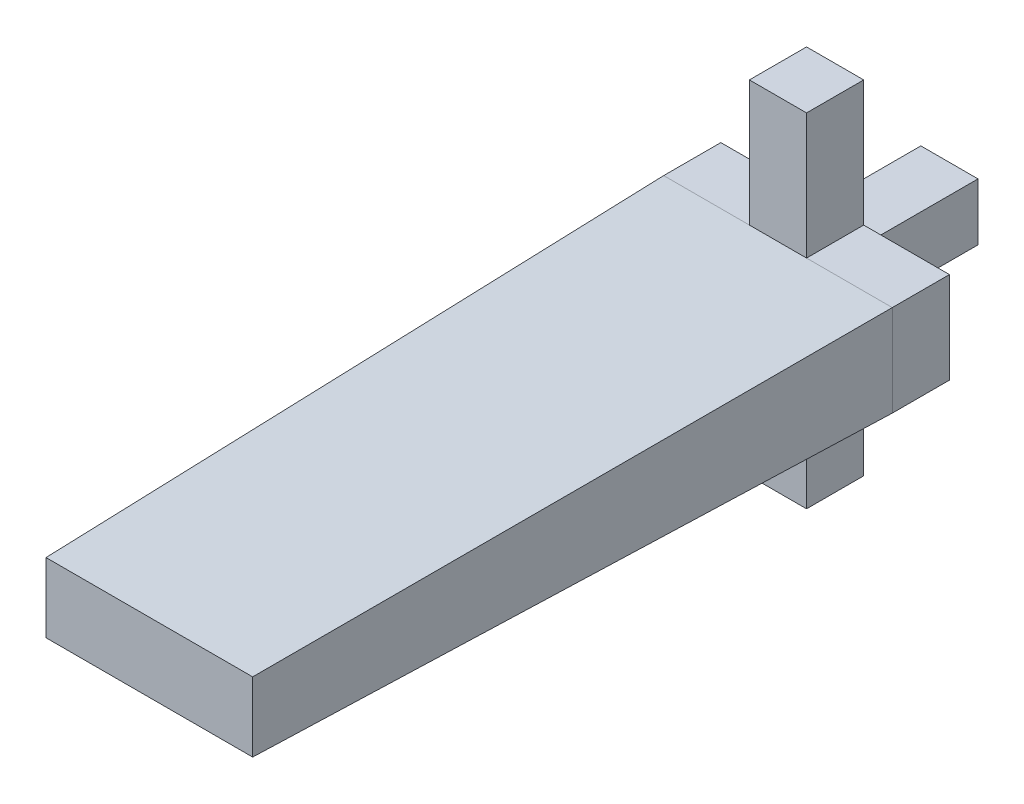
ISO-10303-21;
HEADER;
FILE_DESCRIPTION(('STEP AP214'),'2;1');
FILE_NAME('part.step','',(''),(''),'','','');
FILE_SCHEMA(('AUTOMOTIVE_DESIGN { 1 0 10303 214 1 1 1 1 }'));
ENDSEC;
DATA;
#1=APPLICATION_CONTEXT('core data for automotive mechanical design processes');
#2=APPLICATION_PROTOCOL_DEFINITION('international standard','automotive_design',2000,#1);
#3=PRODUCT_CONTEXT('',#1,'mechanical');
#4=PRODUCT('Part','Part','',(#3));
#5=PRODUCT_RELATED_PRODUCT_CATEGORY('part','',(#4));
#6=PRODUCT_DEFINITION_FORMATION('','',#4);
#7=PRODUCT_DEFINITION_CONTEXT('part definition',#1,'design');
#8=PRODUCT_DEFINITION('design','',#6,#7);
#9=PRODUCT_DEFINITION_SHAPE('','',#8);
#10=(LENGTH_UNIT() NAMED_UNIT(*) SI_UNIT(.MILLI.,.METRE.));
#11=(NAMED_UNIT(*) PLANE_ANGLE_UNIT() SI_UNIT($,.RADIAN.));
#12=(NAMED_UNIT(*) SI_UNIT($,.STERADIAN.) SOLID_ANGLE_UNIT());
#13=UNCERTAINTY_MEASURE_WITH_UNIT(LENGTH_MEASURE(1.E-05),#10,'distance_accuracy_value','');
#14=(GEOMETRIC_REPRESENTATION_CONTEXT(3) GLOBAL_UNCERTAINTY_ASSIGNED_CONTEXT((#13)) GLOBAL_UNIT_ASSIGNED_CONTEXT((#10,
#11,#12)) REPRESENTATION_CONTEXT('',''));
#15=CARTESIAN_POINT('',(0.,0.,0.));
#16=DIRECTION('',(0.,0.,1.));
#17=DIRECTION('',(1.,0.,0.));
#18=AXIS2_PLACEMENT_3D('',#15,#16,#17);
#19=CARTESIAN_POINT('',(-10.,-4.,5.));
#20=DIRECTION('',(0.,1.,0.));
#21=DIRECTION('',(0.,0.,1.));
#22=AXIS2_PLACEMENT_3D('',#19,#20,#21);
#23=PLANE('',#22);
#24=DIRECTION('',(0.,0.,1.));
#25=VECTOR('',#24,1.);
#26=CARTESIAN_POINT('',(2.5,-4.,0.));
#27=LINE('',#26,#25);
#28=CARTESIAN_POINT('',(2.5,-4.,0.));
#29=VERTEX_POINT('',#28);
#30=CARTESIAN_POINT('',(2.5,-4.,5.));
#31=VERTEX_POINT('',#30);
#32=EDGE_CURVE('E182',#29,#31,#27,.T.);
#33=ORIENTED_EDGE('',*,*,#32,.F.);
#34=DIRECTION('',(1.,0.,0.));
#35=VECTOR('',#34,1.);
#36=CARTESIAN_POINT('',(-10.,-4.,0.));
#37=LINE('',#36,#35);
#38=CARTESIAN_POINT('',(10.,-4.,0.));
#39=VERTEX_POINT('',#38);
#40=EDGE_CURVE('E294',#29,#39,#37,.T.);
#41=ORIENTED_EDGE('',*,*,#40,.T.);
#42=DIRECTION('',(0.,0.,-1.));
#43=VECTOR('',#42,1.);
#44=CARTESIAN_POINT('',(10.,-4.,5.));
#45=LINE('',#44,#43);
#46=CARTESIAN_POINT('',(10.,-4.,5.));
#47=VERTEX_POINT('',#46);
#48=EDGE_CURVE('E286',#47,#39,#45,.T.);
#49=ORIENTED_EDGE('',*,*,#48,.F.);
#50=DIRECTION('',(1.,0.,0.));
#51=VECTOR('',#50,1.);
#52=CARTESIAN_POINT('',(-10.,-4.,5.));
#53=LINE('',#52,#51);
#54=EDGE_CURVE('E48',#31,#47,#53,.T.);
#55=ORIENTED_EDGE('',*,*,#54,.F.);
#56=EDGE_LOOP('',(#33,#41,#49,#55));
#57=FACE_BOUND('',#56,.T.);
#58=ADVANCED_FACE('F33',(#57),#23,.F.);
#59=DIRECTION('',(0.,0.,-1.));
#60=VECTOR('',#59,1.);
#61=CARTESIAN_POINT('',(-2.5,-4.,0.));
#62=LINE('',#61,#60);
#63=CARTESIAN_POINT('',(-2.5,-4.,5.));
#64=VERTEX_POINT('',#63);
#65=CARTESIAN_POINT('',(-2.5,-4.,0.));
#66=VERTEX_POINT('',#65);
#67=EDGE_CURVE('E56',#64,#66,#62,.T.);
#68=ORIENTED_EDGE('',*,*,#67,.F.);
#69=CARTESIAN_POINT('',(-10.,-4.,5.));
#70=VERTEX_POINT('',#69);
#71=EDGE_CURVE('E284',#70,#64,#53,.T.);
#72=ORIENTED_EDGE('',*,*,#71,.F.);
#73=DIRECTION('',(0.,0.,-1.));
#74=VECTOR('',#73,1.);
#75=CARTESIAN_POINT('',(-10.,-4.,5.));
#76=LINE('',#75,#74);
#77=CARTESIAN_POINT('',(-10.,-4.,0.));
#78=VERTEX_POINT('',#77);
#79=EDGE_CURVE('E298',#70,#78,#76,.T.);
#80=ORIENTED_EDGE('',*,*,#79,.T.);
#81=EDGE_CURVE('E277',#78,#66,#37,.T.);
#82=ORIENTED_EDGE('',*,*,#81,.T.);
#83=EDGE_LOOP('',(#68,#72,#80,#82));
#84=FACE_BOUND('',#83,.T.);
#85=ADVANCED_FACE('F317',(#84),#23,.F.);
#86=CARTESIAN_POINT('',(-10.,4.,5.));
#87=DIRECTION('',(0.,-1.,0.));
#88=DIRECTION('',(0.,0.,-1.));
#89=AXIS2_PLACEMENT_3D('',#86,#87,#88);
#90=PLANE('',#89);
#91=DIRECTION('',(0.,0.,-1.));
#92=VECTOR('',#91,1.);
#93=CARTESIAN_POINT('',(2.5,4.,0.));
#94=LINE('',#93,#92);
#95=CARTESIAN_POINT('',(2.5,4.,5.));
#96=VERTEX_POINT('',#95);
#97=CARTESIAN_POINT('',(2.5,4.,0.));
#98=VERTEX_POINT('',#97);
#99=EDGE_CURVE('E183',#96,#98,#94,.T.);
#100=ORIENTED_EDGE('',*,*,#99,.F.);
#101=DIRECTION('',(-1.,0.,0.));
#102=VECTOR('',#101,1.);
#103=CARTESIAN_POINT('',(-10.,4.,5.));
#104=LINE('',#103,#102);
#105=CARTESIAN_POINT('',(10.,4.,5.));
#106=VERTEX_POINT('',#105);
#107=EDGE_CURVE('E278',#106,#96,#104,.T.);
#108=ORIENTED_EDGE('',*,*,#107,.F.);
#109=DIRECTION('',(0.,0.,-1.));
#110=VECTOR('',#109,1.);
#111=CARTESIAN_POINT('',(10.,4.,5.));
#112=LINE('',#111,#110);
#113=CARTESIAN_POINT('',(10.,4.,0.));
#114=VERTEX_POINT('',#113);
#115=EDGE_CURVE('E11',#106,#114,#112,.T.);
#116=ORIENTED_EDGE('',*,*,#115,.T.);
#117=DIRECTION('',(-1.,0.,0.));
#118=VECTOR('',#117,1.);
#119=CARTESIAN_POINT('',(-10.,4.,0.));
#120=LINE('',#119,#118);
#121=EDGE_CURVE('E290',#114,#98,#120,.T.);
#122=ORIENTED_EDGE('',*,*,#121,.T.);
#123=EDGE_LOOP('',(#100,#108,#116,#122));
#124=FACE_BOUND('',#123,.T.);
#125=ADVANCED_FACE('F363',(#124),#90,.F.);
#126=DIRECTION('',(0.,0.,1.));
#127=VECTOR('',#126,1.);
#128=CARTESIAN_POINT('',(-2.5,4.,0.));
#129=LINE('',#128,#127);
#130=CARTESIAN_POINT('',(-2.5,4.,0.));
#131=VERTEX_POINT('',#130);
#132=CARTESIAN_POINT('',(-2.5,4.,5.));
#133=VERTEX_POINT('',#132);
#134=EDGE_CURVE('E186',#131,#133,#129,.T.);
#135=ORIENTED_EDGE('',*,*,#134,.F.);
#136=CARTESIAN_POINT('',(-10.,4.,0.));
#137=VERTEX_POINT('',#136);
#138=EDGE_CURVE('E289',#131,#137,#120,.T.);
#139=ORIENTED_EDGE('',*,*,#138,.T.);
#140=DIRECTION('',(0.,0.,-1.));
#141=VECTOR('',#140,1.);
#142=CARTESIAN_POINT('',(-10.,4.,5.));
#143=LINE('',#142,#141);
#144=CARTESIAN_POINT('',(-10.,4.,5.));
#145=VERTEX_POINT('',#144);
#146=EDGE_CURVE('E41',#145,#137,#143,.T.);
#147=ORIENTED_EDGE('',*,*,#146,.F.);
#148=EDGE_CURVE('E276',#133,#145,#104,.T.);
#149=ORIENTED_EDGE('',*,*,#148,.F.);
#150=EDGE_LOOP('',(#135,#139,#147,#149));
#151=FACE_BOUND('',#150,.T.);
#152=ADVANCED_FACE('F347',(#151),#90,.F.);
#153=CARTESIAN_POINT('',(0.,0.,0.));
#154=DIRECTION('',(0.,0.,1.));
#155=DIRECTION('',(1.,0.,0.));
#156=AXIS2_PLACEMENT_3D('',#153,#154,#155);
#157=PLANE('',#156);
#158=DIRECTION('',(0.,1.,0.));
#159=VECTOR('',#158,1.);
#160=CARTESIAN_POINT('',(10.,4.,0.));
#161=LINE('',#160,#159);
#162=EDGE_CURVE('E272',#39,#114,#161,.T.);
#163=ORIENTED_EDGE('',*,*,#162,.F.);
#164=ORIENTED_EDGE('',*,*,#40,.F.);
#165=DIRECTION('',(0.,1.,0.));
#166=VECTOR('',#165,1.);
#167=CARTESIAN_POINT('',(2.5,-15.,0.));
#168=LINE('',#167,#166);
#169=CARTESIAN_POINT('',(2.5,-15.,0.));
#170=VERTEX_POINT('',#169);
#171=EDGE_CURVE('E325',#170,#29,#168,.T.);
#172=ORIENTED_EDGE('',*,*,#171,.F.);
#173=DIRECTION('',(1.,0.,0.));
#174=VECTOR('',#173,1.);
#175=CARTESIAN_POINT('',(2.5,-15.,0.));
#176=LINE('',#175,#174);
#177=CARTESIAN_POINT('',(-2.5,-15.,0.));
#178=VERTEX_POINT('',#177);
#179=EDGE_CURVE('E176',#178,#170,#176,.T.);
#180=ORIENTED_EDGE('',*,*,#179,.F.);
#181=DIRECTION('',(0.,1.,0.));
#182=VECTOR('',#181,1.);
#183=CARTESIAN_POINT('',(-2.5,-15.,0.));
#184=LINE('',#183,#182);
#185=EDGE_CURVE('E188',#178,#66,#184,.T.);
#186=ORIENTED_EDGE('',*,*,#185,.T.);
#187=ORIENTED_EDGE('',*,*,#81,.F.);
#188=DIRECTION('',(0.,-1.,0.));
#189=VECTOR('',#188,1.);
#190=CARTESIAN_POINT('',(-10.,4.,0.));
#191=LINE('',#190,#189);
#192=EDGE_CURVE('E292',#137,#78,#191,.T.);
#193=ORIENTED_EDGE('',*,*,#192,.F.);
#194=ORIENTED_EDGE('',*,*,#138,.F.);
#195=DIRECTION('',(0.,-1.,0.));
#196=VECTOR('',#195,1.);
#197=CARTESIAN_POINT('',(-2.5,15.,0.));
#198=LINE('',#197,#196);
#199=CARTESIAN_POINT('',(-2.5,15.,0.));
#200=VERTEX_POINT('',#199);
#201=EDGE_CURVE('E212',#200,#131,#198,.T.);
#202=ORIENTED_EDGE('',*,*,#201,.F.);
#203=DIRECTION('',(-1.,0.,0.));
#204=VECTOR('',#203,1.);
#205=CARTESIAN_POINT('',(2.5,15.,0.));
#206=LINE('',#205,#204);
#207=CARTESIAN_POINT('',(2.5,15.,0.));
#208=VERTEX_POINT('',#207);
#209=EDGE_CURVE('E195',#208,#200,#206,.T.);
#210=ORIENTED_EDGE('',*,*,#209,.F.);
#211=DIRECTION('',(0.,-1.,0.));
#212=VECTOR('',#211,1.);
#213=CARTESIAN_POINT('',(2.5,15.,0.));
#214=LINE('',#213,#212);
#215=EDGE_CURVE('E215',#208,#98,#214,.T.);
#216=ORIENTED_EDGE('',*,*,#215,.T.);
#217=ORIENTED_EDGE('',*,*,#121,.F.);
#218=EDGE_LOOP('',(#163,#164,#172,#180,#186,#187,#193,#194,#202,#210,#216,#217));
#219=FACE_BOUND('',#218,.T.);
#220=DIRECTION('',(0.,1.,0.));
#221=VECTOR('',#220,1.);
#222=CARTESIAN_POINT('',(-2.5,-2.5,0.));
#223=LINE('',#222,#221);
#224=CARTESIAN_POINT('',(-2.5,-2.5,0.));
#225=VERTEX_POINT('',#224);
#226=CARTESIAN_POINT('',(-2.5,2.5,0.));
#227=VERTEX_POINT('',#226);
#228=EDGE_CURVE('E222',#225,#227,#223,.T.);
#229=ORIENTED_EDGE('',*,*,#228,.F.);
#230=DIRECTION('',(-1.,0.,0.));
#231=VECTOR('',#230,1.);
#232=CARTESIAN_POINT('',(2.5,-2.5,0.));
#233=LINE('',#232,#231);
#234=CARTESIAN_POINT('',(2.5,-2.5,0.));
#235=VERTEX_POINT('',#234);
#236=EDGE_CURVE('E244',#235,#225,#233,.T.);
#237=ORIENTED_EDGE('',*,*,#236,.F.);
#238=DIRECTION('',(0.,-1.,0.));
#239=VECTOR('',#238,1.);
#240=CARTESIAN_POINT('',(2.5,-2.5,0.));
#241=LINE('',#240,#239);
#242=CARTESIAN_POINT('',(2.5,2.5,0.));
#243=VERTEX_POINT('',#242);
#244=EDGE_CURVE('E256',#243,#235,#241,.T.);
#245=ORIENTED_EDGE('',*,*,#244,.F.);
#246=DIRECTION('',(1.,0.,0.));
#247=VECTOR('',#246,1.);
#248=CARTESIAN_POINT('',(2.5,2.5,0.));
#249=LINE('',#248,#247);
#250=EDGE_CURVE('E253',#227,#243,#249,.T.);
#251=ORIENTED_EDGE('',*,*,#250,.F.);
#252=EDGE_LOOP('',(#229,#237,#245,#251));
#253=FACE_BOUND('',#252,.T.);
#254=ADVANCED_FACE('F312',(#219,#253),#157,.F.);
#255=CARTESIAN_POINT('',(10.,4.,5.));
#256=DIRECTION('',(-1.,0.,0.));
#257=DIRECTION('',(0.,0.,1.));
#258=AXIS2_PLACEMENT_3D('',#255,#256,#257);
#259=PLANE('',#258);
#260=ORIENTED_EDGE('',*,*,#162,.T.);
#261=ORIENTED_EDGE('',*,*,#115,.F.);
#262=DIRECTION('',(0.,1.,0.));
#263=VECTOR('',#262,1.);
#264=CARTESIAN_POINT('',(10.,4.,5.));
#265=LINE('',#264,#263);
#266=EDGE_CURVE('E273',#47,#106,#265,.T.);
#267=ORIENTED_EDGE('',*,*,#266,.F.);
#268=ORIENTED_EDGE('',*,*,#48,.T.);
#269=EDGE_LOOP('',(#260,#261,#267,#268));
#270=FACE_BOUND('',#269,.T.);
#271=ADVANCED_FACE('F35',(#270),#259,.F.);
#272=CARTESIAN_POINT('',(-10.,4.,5.));
#273=DIRECTION('',(1.,0.,0.));
#274=DIRECTION('',(0.,0.,-1.));
#275=AXIS2_PLACEMENT_3D('',#272,#273,#274);
#276=PLANE('',#275);
#277=ORIENTED_EDGE('',*,*,#192,.T.);
#278=ORIENTED_EDGE('',*,*,#79,.F.);
#279=DIRECTION('',(0.,-1.,0.));
#280=VECTOR('',#279,1.);
#281=CARTESIAN_POINT('',(-10.,4.,5.));
#282=LINE('',#281,#280);
#283=EDGE_CURVE('E281',#145,#70,#282,.T.);
#284=ORIENTED_EDGE('',*,*,#283,.F.);
#285=ORIENTED_EDGE('',*,*,#146,.T.);
#286=EDGE_LOOP('',(#277,#278,#284,#285));
#287=FACE_BOUND('',#286,.T.);
#288=ADVANCED_FACE('F305',(#287),#276,.F.);
#289=CARTESIAN_POINT('',(-2.5,-2.5,-10.));
#290=DIRECTION('',(1.,0.,0.));
#291=DIRECTION('',(0.,0.,-1.));
#292=AXIS2_PLACEMENT_3D('',#289,#290,#291);
#293=PLANE('',#292);
#294=ORIENTED_EDGE('',*,*,#228,.T.);
#295=DIRECTION('',(0.,0.,1.));
#296=VECTOR('',#295,1.);
#297=CARTESIAN_POINT('',(-2.5,2.5,-10.));
#298=LINE('',#297,#296);
#299=CARTESIAN_POINT('',(-2.5,2.5,-10.));
#300=VERTEX_POINT('',#299);
#301=EDGE_CURVE('E269',#300,#227,#298,.T.);
#302=ORIENTED_EDGE('',*,*,#301,.F.);
#303=DIRECTION('',(0.,1.,0.));
#304=VECTOR('',#303,1.);
#305=CARTESIAN_POINT('',(-2.5,-2.5,-10.));
#306=LINE('',#305,#304);
#307=CARTESIAN_POINT('',(-2.5,-2.5,-10.));
#308=VERTEX_POINT('',#307);
#309=EDGE_CURVE('E240',#308,#300,#306,.T.);
#310=ORIENTED_EDGE('',*,*,#309,.F.);
#311=DIRECTION('',(0.,0.,1.));
#312=VECTOR('',#311,1.);
#313=CARTESIAN_POINT('',(-2.5,-2.5,-10.));
#314=LINE('',#313,#312);
#315=EDGE_CURVE('E250',#308,#225,#314,.T.);
#316=ORIENTED_EDGE('',*,*,#315,.T.);
#317=EDGE_LOOP('',(#294,#302,#310,#316));
#318=FACE_BOUND('',#317,.T.);
#319=ADVANCED_FACE('F377',(#318),#293,.F.);
#320=CARTESIAN_POINT('',(2.5,2.5,-10.));
#321=DIRECTION('',(0.,-1.,0.));
#322=DIRECTION('',(0.,0.,-1.));
#323=AXIS2_PLACEMENT_3D('',#320,#321,#322);
#324=PLANE('',#323);
#325=ORIENTED_EDGE('',*,*,#250,.T.);
#326=DIRECTION('',(0.,0.,1.));
#327=VECTOR('',#326,1.);
#328=CARTESIAN_POINT('',(2.5,2.5,-10.));
#329=LINE('',#328,#327);
#330=CARTESIAN_POINT('',(2.5,2.5,-10.));
#331=VERTEX_POINT('',#330);
#332=EDGE_CURVE('E266',#331,#243,#329,.T.);
#333=ORIENTED_EDGE('',*,*,#332,.F.);
#334=DIRECTION('',(1.,0.,0.));
#335=VECTOR('',#334,1.);
#336=CARTESIAN_POINT('',(2.5,2.5,-10.));
#337=LINE('',#336,#335);
#338=EDGE_CURVE('E243',#300,#331,#337,.T.);
#339=ORIENTED_EDGE('',*,*,#338,.F.);
#340=ORIENTED_EDGE('',*,*,#301,.T.);
#341=EDGE_LOOP('',(#325,#333,#339,#340));
#342=FACE_BOUND('',#341,.T.);
#343=ADVANCED_FACE('F382',(#342),#324,.F.);
#344=CARTESIAN_POINT('',(2.5,-2.5,-10.));
#345=DIRECTION('',(-1.,0.,0.));
#346=DIRECTION('',(0.,0.,1.));
#347=AXIS2_PLACEMENT_3D('',#344,#345,#346);
#348=PLANE('',#347);
#349=ORIENTED_EDGE('',*,*,#244,.T.);
#350=DIRECTION('',(0.,0.,1.));
#351=VECTOR('',#350,1.);
#352=CARTESIAN_POINT('',(2.5,-2.5,-10.));
#353=LINE('',#352,#351);
#354=CARTESIAN_POINT('',(2.5,-2.5,-10.));
#355=VERTEX_POINT('',#354);
#356=EDGE_CURVE('E263',#355,#235,#353,.T.);
#357=ORIENTED_EDGE('',*,*,#356,.F.);
#358=DIRECTION('',(0.,-1.,0.));
#359=VECTOR('',#358,1.);
#360=CARTESIAN_POINT('',(2.5,-2.5,-10.));
#361=LINE('',#360,#359);
#362=EDGE_CURVE('E246',#331,#355,#361,.T.);
#363=ORIENTED_EDGE('',*,*,#362,.F.);
#364=ORIENTED_EDGE('',*,*,#332,.T.);
#365=EDGE_LOOP('',(#349,#357,#363,#364));
#366=FACE_BOUND('',#365,.T.);
#367=ADVANCED_FACE('F510',(#366),#348,.F.);
#368=CARTESIAN_POINT('',(2.5,-2.5,-10.));
#369=DIRECTION('',(0.,1.,0.));
#370=DIRECTION('',(0.,0.,1.));
#371=AXIS2_PLACEMENT_3D('',#368,#369,#370);
#372=PLANE('',#371);
#373=ORIENTED_EDGE('',*,*,#236,.T.);
#374=ORIENTED_EDGE('',*,*,#315,.F.);
#375=DIRECTION('',(-1.,0.,0.));
#376=VECTOR('',#375,1.);
#377=CARTESIAN_POINT('',(2.5,-2.5,-10.));
#378=LINE('',#377,#376);
#379=EDGE_CURVE('E248',#355,#308,#378,.T.);
#380=ORIENTED_EDGE('',*,*,#379,.F.);
#381=ORIENTED_EDGE('',*,*,#356,.T.);
#382=EDGE_LOOP('',(#373,#374,#380,#381));
#383=FACE_BOUND('',#382,.T.);
#384=ADVANCED_FACE('F506',(#383),#372,.F.);
#385=CARTESIAN_POINT('',(0.,0.,-10.));
#386=DIRECTION('',(0.,0.,1.));
#387=DIRECTION('',(1.,0.,0.));
#388=AXIS2_PLACEMENT_3D('',#385,#386,#387);
#389=PLANE('',#388);
#390=ORIENTED_EDGE('',*,*,#309,.T.);
#391=ORIENTED_EDGE('',*,*,#338,.T.);
#392=ORIENTED_EDGE('',*,*,#362,.T.);
#393=ORIENTED_EDGE('',*,*,#379,.T.);
#394=EDGE_LOOP('',(#390,#391,#392,#393));
#395=FACE_BOUND('',#394,.T.);
#396=ADVANCED_FACE('F500',(#395),#389,.F.);
#397=CARTESIAN_POINT('',(10.,4.,5.));
#398=DIRECTION('',(0.999847695156391,0.,0.0174524064372835));
#399=DIRECTION('',(0.0174524064372835,0.,-0.999847695156391));
#400=AXIS2_PLACEMENT_3D('',#397,#398,#399);
#401=PLANE('',#400);
#402=ORIENTED_EDGE('',*,*,#266,.T.);
#403=DIRECTION('',(0.0174497491606827,0.0174497491606827,-0.999695459881887));
#404=VECTOR('',#403,1.);
#405=CARTESIAN_POINT('',(10.,4.,5.));
#406=LINE('',#405,#404);
#407=CARTESIAN_POINT('',(9.03997142894803,3.03997142894803,60.));
#408=VERTEX_POINT('',#407);
#409=EDGE_CURVE('E219',#408,#106,#406,.T.);
#410=ORIENTED_EDGE('',*,*,#409,.F.);
#411=DIRECTION('',(0.,-1.,0.));
#412=VECTOR('',#411,1.);
#413=CARTESIAN_POINT('',(9.03997142894803,0.,60.));
#414=LINE('',#413,#412);
#415=CARTESIAN_POINT('',(9.03997142894803,-3.03997142894803,60.));
#416=VERTEX_POINT('',#415);
#417=EDGE_CURVE('E218',#416,#408,#414,.F.);
#418=ORIENTED_EDGE('',*,*,#417,.F.);
#419=DIRECTION('',(0.0174497491606827,-0.0174497491606827,-0.999695459881887));
#420=VECTOR('',#419,1.);
#421=CARTESIAN_POINT('',(9.99756405003383,-3.99756405003383,5.1395554800961));
#422=LINE('',#421,#420);
#423=EDGE_CURVE('E224',#416,#47,#422,.T.);
#424=ORIENTED_EDGE('',*,*,#423,.T.);
#425=EDGE_LOOP('',(#402,#410,#418,#424));
#426=FACE_BOUND('',#425,.T.);
#427=ADVANCED_FACE('F334',(#426),#401,.T.);
#428=CARTESIAN_POINT('',(10.,4.,5.));
#429=DIRECTION('',(0.,0.999847695156391,0.0174524064372835));
#430=DIRECTION('',(0.,-0.0174524064372835,0.999847695156391));
#431=AXIS2_PLACEMENT_3D('',#428,#429,#430);
#432=PLANE('',#431);
#433=ORIENTED_EDGE('',*,*,#107,.T.);
#434=DIRECTION('',(1.,0.,0.));
#435=VECTOR('',#434,1.);
#436=CARTESIAN_POINT('',(2.5,4.,5.));
#437=LINE('',#436,#435);
#438=EDGE_CURVE('E196',#133,#96,#437,.T.);
#439=ORIENTED_EDGE('',*,*,#438,.F.);
#440=ORIENTED_EDGE('',*,*,#148,.T.);
#441=DIRECTION('',(-0.0174497491606827,0.0174497491606827,-0.999695459881887));
#442=VECTOR('',#441,1.);
#443=CARTESIAN_POINT('',(-10.,4.,5.));
#444=LINE('',#443,#442);
#445=CARTESIAN_POINT('',(-9.03997142894803,3.03997142894803,60.));
#446=VERTEX_POINT('',#445);
#447=EDGE_CURVE('E223',#446,#145,#444,.T.);
#448=ORIENTED_EDGE('',*,*,#447,.F.);
#449=DIRECTION('',(1.,0.,0.));
#450=VECTOR('',#449,1.);
#451=CARTESIAN_POINT('',(0.,3.03997142894803,60.));
#452=LINE('',#451,#450);
#453=EDGE_CURVE('E235',#408,#446,#452,.F.);
#454=ORIENTED_EDGE('',*,*,#453,.F.);
#455=ORIENTED_EDGE('',*,*,#409,.T.);
#456=EDGE_LOOP('',(#433,#439,#440,#448,#454,#455));
#457=FACE_BOUND('',#456,.T.);
#458=ADVANCED_FACE('F346',(#457),#432,.T.);
#459=CARTESIAN_POINT('',(-10.,4.,5.));
#460=DIRECTION('',(-0.999847695156391,0.,0.0174524064372835));
#461=DIRECTION('',(0.0174524064372835,0.,0.999847695156391));
#462=AXIS2_PLACEMENT_3D('',#459,#460,#461);
#463=PLANE('',#462);
#464=ORIENTED_EDGE('',*,*,#283,.T.);
#465=DIRECTION('',(-0.0174497491606827,-0.0174497491606827,-0.999695459881887));
#466=VECTOR('',#465,1.);
#467=CARTESIAN_POINT('',(-9.99391012508459,-3.99391012508458,5.34888870024025));
#468=LINE('',#467,#466);
#469=CARTESIAN_POINT('',(-9.03997142894803,-3.03997142894803,60.));
#470=VERTEX_POINT('',#469);
#471=EDGE_CURVE('E227',#470,#70,#468,.T.);
#472=ORIENTED_EDGE('',*,*,#471,.F.);
#473=DIRECTION('',(0.,1.,0.));
#474=VECTOR('',#473,1.);
#475=CARTESIAN_POINT('',(-9.03997142894803,0.,60.));
#476=LINE('',#475,#474);
#477=EDGE_CURVE('E237',#446,#470,#476,.F.);
#478=ORIENTED_EDGE('',*,*,#477,.F.);
#479=ORIENTED_EDGE('',*,*,#447,.T.);
#480=EDGE_LOOP('',(#464,#472,#478,#479));
#481=FACE_BOUND('',#480,.T.);
#482=ADVANCED_FACE('F342',(#481),#463,.T.);
#483=CARTESIAN_POINT('',(10.,-4.,5.));
#484=DIRECTION('',(0.,-0.999847695156391,0.0174524064372835));
#485=DIRECTION('',(0.,-0.0174524064372835,-0.999847695156391));
#486=AXIS2_PLACEMENT_3D('',#483,#484,#485);
#487=PLANE('',#486);
#488=ORIENTED_EDGE('',*,*,#71,.T.);
#489=DIRECTION('',(-1.,0.,0.));
#490=VECTOR('',#489,1.);
#491=CARTESIAN_POINT('',(2.5,-4.,5.));
#492=LINE('',#491,#490);
#493=EDGE_CURVE('E320',#31,#64,#492,.T.);
#494=ORIENTED_EDGE('',*,*,#493,.F.);
#495=ORIENTED_EDGE('',*,*,#54,.T.);
#496=ORIENTED_EDGE('',*,*,#423,.F.);
#497=DIRECTION('',(-1.,0.,0.));
#498=VECTOR('',#497,1.);
#499=CARTESIAN_POINT('',(0.,-3.03997142894803,60.));
#500=LINE('',#499,#498);
#501=EDGE_CURVE('E228',#470,#416,#500,.F.);
#502=ORIENTED_EDGE('',*,*,#501,.F.);
#503=ORIENTED_EDGE('',*,*,#471,.T.);
#504=EDGE_LOOP('',(#488,#494,#495,#496,#502,#503));
#505=FACE_BOUND('',#504,.T.);
#506=ADVANCED_FACE('F339',(#505),#487,.T.);
#507=CARTESIAN_POINT('',(0.,0.,60.));
#508=DIRECTION('',(0.,0.,-1.));
#509=DIRECTION('',(-1.,0.,0.));
#510=AXIS2_PLACEMENT_3D('',#507,#508,#509);
#511=PLANE('',#510);
#512=ORIENTED_EDGE('',*,*,#417,.T.);
#513=ORIENTED_EDGE('',*,*,#453,.T.);
#514=ORIENTED_EDGE('',*,*,#477,.T.);
#515=ORIENTED_EDGE('',*,*,#501,.T.);
#516=EDGE_LOOP('',(#512,#513,#514,#515));
#517=FACE_BOUND('',#516,.T.);
#518=ADVANCED_FACE('F420',(#517),#511,.F.);
#519=CARTESIAN_POINT('',(2.5,15.,0.));
#520=DIRECTION('',(-1.,0.,0.));
#521=DIRECTION('',(0.,0.,1.));
#522=AXIS2_PLACEMENT_3D('',#519,#520,#521);
#523=PLANE('',#522);
#524=ORIENTED_EDGE('',*,*,#99,.T.);
#525=ORIENTED_EDGE('',*,*,#215,.F.);
#526=DIRECTION('',(0.,0.,-1.));
#527=VECTOR('',#526,1.);
#528=CARTESIAN_POINT('',(2.5,15.,0.));
#529=LINE('',#528,#527);
#530=CARTESIAN_POINT('',(2.5,15.,5.));
#531=VERTEX_POINT('',#530);
#532=EDGE_CURVE('E192',#531,#208,#529,.T.);
#533=ORIENTED_EDGE('',*,*,#532,.F.);
#534=DIRECTION('',(0.,-1.,0.));
#535=VECTOR('',#534,1.);
#536=CARTESIAN_POINT('',(2.5,15.,5.));
#537=LINE('',#536,#535);
#538=EDGE_CURVE('E201',#531,#96,#537,.T.);
#539=ORIENTED_EDGE('',*,*,#538,.T.);
#540=EDGE_LOOP('',(#524,#525,#533,#539));
#541=FACE_BOUND('',#540,.T.);
#542=ADVANCED_FACE('F361',(#541),#523,.F.);
#543=CARTESIAN_POINT('',(-2.5,15.,0.));
#544=DIRECTION('',(1.,0.,0.));
#545=DIRECTION('',(0.,0.,-1.));
#546=AXIS2_PLACEMENT_3D('',#543,#544,#545);
#547=PLANE('',#546);
#548=ORIENTED_EDGE('',*,*,#134,.T.);
#549=DIRECTION('',(0.,-1.,0.));
#550=VECTOR('',#549,1.);
#551=CARTESIAN_POINT('',(-2.5,15.,5.));
#552=LINE('',#551,#550);
#553=CARTESIAN_POINT('',(-2.5,15.,5.));
#554=VERTEX_POINT('',#553);
#555=EDGE_CURVE('E209',#554,#133,#552,.T.);
#556=ORIENTED_EDGE('',*,*,#555,.F.);
#557=DIRECTION('',(0.,0.,1.));
#558=VECTOR('',#557,1.);
#559=CARTESIAN_POINT('',(-2.5,15.,0.));
#560=LINE('',#559,#558);
#561=EDGE_CURVE('E198',#200,#554,#560,.T.);
#562=ORIENTED_EDGE('',*,*,#561,.F.);
#563=ORIENTED_EDGE('',*,*,#201,.T.);
#564=EDGE_LOOP('',(#548,#556,#562,#563));
#565=FACE_BOUND('',#564,.T.);
#566=ADVANCED_FACE('F350',(#565),#547,.F.);
#567=CARTESIAN_POINT('',(2.5,15.,5.));
#568=DIRECTION('',(0.,0.,-1.));
#569=DIRECTION('',(-1.,0.,0.));
#570=AXIS2_PLACEMENT_3D('',#567,#568,#569);
#571=PLANE('',#570);
#572=ORIENTED_EDGE('',*,*,#438,.T.);
#573=ORIENTED_EDGE('',*,*,#538,.F.);
#574=DIRECTION('',(1.,0.,0.));
#575=VECTOR('',#574,1.);
#576=CARTESIAN_POINT('',(2.5,15.,5.));
#577=LINE('',#576,#575);
#578=EDGE_CURVE('E200',#554,#531,#577,.T.);
#579=ORIENTED_EDGE('',*,*,#578,.F.);
#580=ORIENTED_EDGE('',*,*,#555,.T.);
#581=EDGE_LOOP('',(#572,#573,#579,#580));
#582=FACE_BOUND('',#581,.T.);
#583=ADVANCED_FACE('F354',(#582),#571,.F.);
#584=CARTESIAN_POINT('',(0.,15.,0.));
#585=DIRECTION('',(0.,-1.,0.));
#586=DIRECTION('',(0.,0.,-1.));
#587=AXIS2_PLACEMENT_3D('',#584,#585,#586);
#588=PLANE('',#587);
#589=ORIENTED_EDGE('',*,*,#532,.T.);
#590=ORIENTED_EDGE('',*,*,#209,.T.);
#591=ORIENTED_EDGE('',*,*,#561,.T.);
#592=ORIENTED_EDGE('',*,*,#578,.T.);
#593=EDGE_LOOP('',(#589,#590,#591,#592));
#594=FACE_BOUND('',#593,.T.);
#595=ADVANCED_FACE('F358',(#594),#588,.F.);
#596=CARTESIAN_POINT('',(2.5,-15.,0.));
#597=DIRECTION('',(-1.,0.,0.));
#598=DIRECTION('',(0.,0.,1.));
#599=AXIS2_PLACEMENT_3D('',#596,#597,#598);
#600=PLANE('',#599);
#601=ORIENTED_EDGE('',*,*,#32,.T.);
#602=DIRECTION('',(0.,1.,0.));
#603=VECTOR('',#602,1.);
#604=CARTESIAN_POINT('',(2.5,-15.,5.));
#605=LINE('',#604,#603);
#606=CARTESIAN_POINT('',(2.5,-15.,5.));
#607=VERTEX_POINT('',#606);
#608=EDGE_CURVE('E164',#607,#31,#605,.T.);
#609=ORIENTED_EDGE('',*,*,#608,.F.);
#610=DIRECTION('',(0.,0.,1.));
#611=VECTOR('',#610,1.);
#612=CARTESIAN_POINT('',(2.5,-15.,0.));
#613=LINE('',#612,#611);
#614=EDGE_CURVE('E171',#170,#607,#613,.T.);
#615=ORIENTED_EDGE('',*,*,#614,.F.);
#616=ORIENTED_EDGE('',*,*,#171,.T.);
#617=EDGE_LOOP('',(#601,#609,#615,#616));
#618=FACE_BOUND('',#617,.T.);
#619=ADVANCED_FACE('F181',(#618),#600,.F.);
#620=CARTESIAN_POINT('',(2.5,-15.,5.));
#621=DIRECTION('',(0.,0.,-1.));
#622=DIRECTION('',(-1.,0.,0.));
#623=AXIS2_PLACEMENT_3D('',#620,#621,#622);
#624=PLANE('',#623);
#625=ORIENTED_EDGE('',*,*,#493,.T.);
#626=DIRECTION('',(0.,1.,0.));
#627=VECTOR('',#626,1.);
#628=CARTESIAN_POINT('',(-2.5,-15.,5.));
#629=LINE('',#628,#627);
#630=CARTESIAN_POINT('',(-2.5,-15.,5.));
#631=VERTEX_POINT('',#630);
#632=EDGE_CURVE('E167',#631,#64,#629,.T.);
#633=ORIENTED_EDGE('',*,*,#632,.F.);
#634=DIRECTION('',(-1.,0.,0.));
#635=VECTOR('',#634,1.);
#636=CARTESIAN_POINT('',(2.5,-15.,5.));
#637=LINE('',#636,#635);
#638=EDGE_CURVE('E159',#607,#631,#637,.T.);
#639=ORIENTED_EDGE('',*,*,#638,.F.);
#640=ORIENTED_EDGE('',*,*,#608,.T.);
#641=EDGE_LOOP('',(#625,#633,#639,#640));
#642=FACE_BOUND('',#641,.T.);
#643=ADVANCED_FACE('F162',(#642),#624,.F.);
#644=CARTESIAN_POINT('',(-2.5,-15.,0.));
#645=DIRECTION('',(1.,0.,0.));
#646=DIRECTION('',(0.,0.,-1.));
#647=AXIS2_PLACEMENT_3D('',#644,#645,#646);
#648=PLANE('',#647);
#649=ORIENTED_EDGE('',*,*,#67,.T.);
#650=ORIENTED_EDGE('',*,*,#185,.F.);
#651=DIRECTION('',(0.,0.,-1.));
#652=VECTOR('',#651,1.);
#653=CARTESIAN_POINT('',(-2.5,-15.,0.));
#654=LINE('',#653,#652);
#655=EDGE_CURVE('E170',#631,#178,#654,.T.);
#656=ORIENTED_EDGE('',*,*,#655,.F.);
#657=ORIENTED_EDGE('',*,*,#632,.T.);
#658=EDGE_LOOP('',(#649,#650,#656,#657));
#659=FACE_BOUND('',#658,.T.);
#660=ADVANCED_FACE('F319',(#659),#648,.F.);
#661=CARTESIAN_POINT('',(0.,-15.,0.));
#662=DIRECTION('',(0.,-1.,0.));
#663=DIRECTION('',(0.,0.,-1.));
#664=AXIS2_PLACEMENT_3D('',#661,#662,#663);
#665=PLANE('',#664);
#666=ORIENTED_EDGE('',*,*,#614,.T.);
#667=ORIENTED_EDGE('',*,*,#638,.T.);
#668=ORIENTED_EDGE('',*,*,#655,.T.);
#669=ORIENTED_EDGE('',*,*,#179,.T.);
#670=EDGE_LOOP('',(#666,#667,#668,#669));
#671=FACE_BOUND('',#670,.T.);
#672=ADVANCED_FACE('F174',(#671),#665,.T.);
#673=CLOSED_SHELL('',(#58,#85,#125,#152,#254,#271,#288,#319,#343,#367,#384,#396,#427,#458,#482,
#506,#518,#542,#566,#583,#595,#619,#643,#660,#672));
#674=MANIFOLD_SOLID_BREP('B2',#673);
#675=ADVANCED_BREP_SHAPE_REPRESENTATION('',(#18,#674),#14);
#676=SHAPE_DEFINITION_REPRESENTATION(#9,#675);
ENDSEC;
END-ISO-10303-21;
